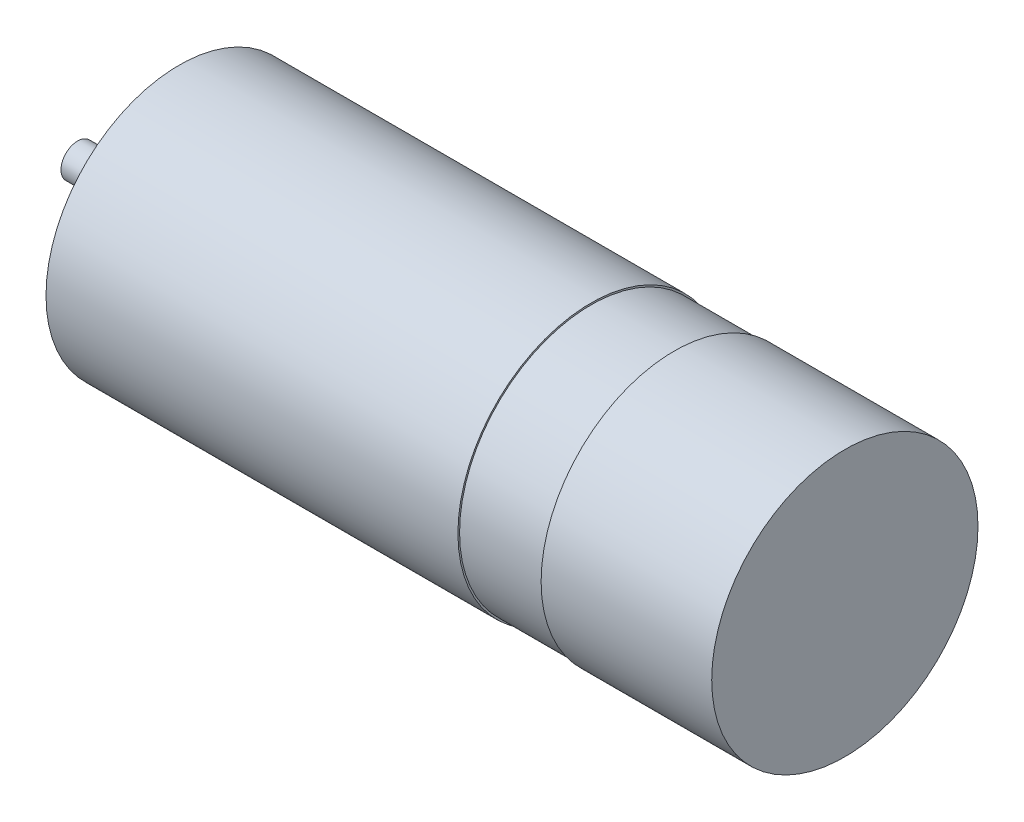
ISO-10303-21;
HEADER;
FILE_DESCRIPTION(('STEP AP214'),'2;1');
FILE_NAME('part.step','',(''),(''),'','','');
FILE_SCHEMA(('AUTOMOTIVE_DESIGN { 1 0 10303 214 1 1 1 1 }'));
ENDSEC;
DATA;
#1=APPLICATION_CONTEXT('core data for automotive mechanical design processes');
#2=APPLICATION_PROTOCOL_DEFINITION('international standard','automotive_design',2000,#1);
#3=PRODUCT_CONTEXT('',#1,'mechanical');
#4=PRODUCT('Part','Part','',(#3));
#5=PRODUCT_RELATED_PRODUCT_CATEGORY('part','',(#4));
#6=PRODUCT_DEFINITION_FORMATION('','',#4);
#7=PRODUCT_DEFINITION_CONTEXT('part definition',#1,'design');
#8=PRODUCT_DEFINITION('design','',#6,#7);
#9=PRODUCT_DEFINITION_SHAPE('','',#8);
#10=(LENGTH_UNIT() NAMED_UNIT(*) SI_UNIT(.MILLI.,.METRE.));
#11=(NAMED_UNIT(*) PLANE_ANGLE_UNIT() SI_UNIT($,.RADIAN.));
#12=(NAMED_UNIT(*) SI_UNIT($,.STERADIAN.) SOLID_ANGLE_UNIT());
#13=UNCERTAINTY_MEASURE_WITH_UNIT(LENGTH_MEASURE(1.E-05),#10,'distance_accuracy_value','');
#14=(GEOMETRIC_REPRESENTATION_CONTEXT(3) GLOBAL_UNCERTAINTY_ASSIGNED_CONTEXT((#13)) GLOBAL_UNIT_ASSIGNED_CONTEXT((#10,
#11,#12)) REPRESENTATION_CONTEXT('',''));
#15=CARTESIAN_POINT('',(0.,0.,0.));
#16=DIRECTION('',(0.,0.,1.));
#17=DIRECTION('',(1.,0.,0.));
#18=AXIS2_PLACEMENT_3D('',#15,#16,#17);
#19=CARTESIAN_POINT('',(0.,1.,0.));
#20=DIRECTION('',(1.,0.,0.));
#21=DIRECTION('',(0.,0.,-1.));
#22=AXIS2_PLACEMENT_3D('',#19,#20,#21);
#23=PLANE('',#22);
#24=CARTESIAN_POINT('',(0.,0.,0.));
#25=DIRECTION('',(-1.,0.,0.));
#26=DIRECTION('',(0.,0.,1.));
#27=AXIS2_PLACEMENT_3D('',#24,#25,#26);
#28=CIRCLE('',#27,1.);
#29=CARTESIAN_POINT('',(0.,0.,1.));
#30=VERTEX_POINT('',#29);
#31=EDGE_CURVE('E65',#30,#30,#28,.T.);
#32=ORIENTED_EDGE('',*,*,#31,.T.);
#33=EDGE_LOOP('',(#32));
#34=FACE_BOUND('',#33,.T.);
#35=ADVANCED_FACE('F31',(#34),#23,.F.);
#36=CARTESIAN_POINT('',(46.1,0.,0.));
#37=DIRECTION('',(-1.,0.,0.));
#38=DIRECTION('',(0.,0.,1.));
#39=AXIS2_PLACEMENT_3D('',#36,#37,#38);
#40=PLANE('',#39);
#41=CARTESIAN_POINT('',(46.1,0.,0.));
#42=DIRECTION('',(-1.,0.,0.));
#43=DIRECTION('',(0.,0.,1.));
#44=AXIS2_PLACEMENT_3D('',#41,#42,#43);
#45=CIRCLE('',#44,8.);
#46=CARTESIAN_POINT('',(46.1,0.,8.));
#47=VERTEX_POINT('',#46);
#48=EDGE_CURVE('E10',#47,#47,#45,.T.);
#49=ORIENTED_EDGE('',*,*,#48,.F.);
#50=EDGE_LOOP('',(#49));
#51=FACE_BOUND('',#50,.T.);
#52=ADVANCED_FACE('F119',(#51),#40,.F.);
#53=CARTESIAN_POINT('',(0.,0.,0.));
#54=DIRECTION('',(-1.,0.,0.));
#55=DIRECTION('',(0.,0.,1.));
#56=AXIS2_PLACEMENT_3D('',#53,#54,#55);
#57=CYLINDRICAL_SURFACE('',#56,8.);
#58=CARTESIAN_POINT('',(35.85,0.,0.));
#59=DIRECTION('',(-1.,0.,0.));
#60=DIRECTION('',(0.,0.,1.));
#61=AXIS2_PLACEMENT_3D('',#58,#59,#60);
#62=CIRCLE('',#61,8.);
#63=CARTESIAN_POINT('',(35.85,0.,8.));
#64=VERTEX_POINT('',#63);
#65=EDGE_CURVE('E37',#64,#64,#62,.T.);
#66=ORIENTED_EDGE('',*,*,#65,.F.);
#67=EDGE_LOOP('',(#66));
#68=FACE_BOUND('',#67,.T.);
#69=ORIENTED_EDGE('',*,*,#48,.T.);
#70=EDGE_LOOP('',(#69));
#71=FACE_BOUND('',#70,.T.);
#72=ADVANCED_FACE('F114',(#68,#71),#57,.T.);
#73=CARTESIAN_POINT('',(35.85,8.,0.));
#74=DIRECTION('',(1.,0.,0.));
#75=DIRECTION('',(0.,0.,-1.));
#76=AXIS2_PLACEMENT_3D('',#73,#74,#75);
#77=PLANE('',#76);
#78=CARTESIAN_POINT('',(35.85,0.,0.));
#79=DIRECTION('',(-1.,0.,0.));
#80=DIRECTION('',(0.,0.,1.));
#81=AXIS2_PLACEMENT_3D('',#78,#79,#80);
#82=CIRCLE('',#81,7.89999999999999);
#83=CARTESIAN_POINT('',(35.85,0.,7.89999999999999));
#84=VERTEX_POINT('',#83);
#85=EDGE_CURVE('E41',#84,#84,#82,.T.);
#86=ORIENTED_EDGE('',*,*,#85,.F.);
#87=EDGE_LOOP('',(#86));
#88=FACE_BOUND('',#87,.T.);
#89=ORIENTED_EDGE('',*,*,#65,.T.);
#90=EDGE_LOOP('',(#89));
#91=FACE_BOUND('',#90,.T.);
#92=ADVANCED_FACE('F109',(#88,#91),#77,.F.);
#93=CARTESIAN_POINT('',(0.,0.,0.));
#94=DIRECTION('',(-1.,0.,0.));
#95=DIRECTION('',(0.,0.,1.));
#96=AXIS2_PLACEMENT_3D('',#93,#94,#95);
#97=CYLINDRICAL_SURFACE('',#96,7.89999999999999);
#98=CARTESIAN_POINT('',(30.85,0.,0.));
#99=DIRECTION('',(-1.,0.,0.));
#100=DIRECTION('',(0.,0.,1.));
#101=AXIS2_PLACEMENT_3D('',#98,#99,#100);
#102=CIRCLE('',#101,7.9);
#103=CARTESIAN_POINT('',(30.85,0.,7.9));
#104=VERTEX_POINT('',#103);
#105=EDGE_CURVE('E45',#104,#104,#102,.T.);
#106=ORIENTED_EDGE('',*,*,#105,.F.);
#107=EDGE_LOOP('',(#106));
#108=FACE_BOUND('',#107,.T.);
#109=ORIENTED_EDGE('',*,*,#85,.T.);
#110=EDGE_LOOP('',(#109));
#111=FACE_BOUND('',#110,.T.);
#112=ADVANCED_FACE('F103',(#108,#111),#97,.T.);
#113=CARTESIAN_POINT('',(30.85,7.9,0.));
#114=DIRECTION('',(-1.,0.,0.));
#115=DIRECTION('',(0.,0.,1.));
#116=AXIS2_PLACEMENT_3D('',#113,#114,#115);
#117=PLANE('',#116);
#118=CARTESIAN_POINT('',(30.85,0.,0.));
#119=DIRECTION('',(-1.,0.,0.));
#120=DIRECTION('',(0.,0.,1.));
#121=AXIS2_PLACEMENT_3D('',#118,#119,#120);
#122=CIRCLE('',#121,8.);
#123=CARTESIAN_POINT('',(30.85,0.,8.));
#124=VERTEX_POINT('',#123);
#125=EDGE_CURVE('E50',#124,#124,#122,.T.);
#126=ORIENTED_EDGE('',*,*,#125,.F.);
#127=EDGE_LOOP('',(#126));
#128=FACE_BOUND('',#127,.T.);
#129=ORIENTED_EDGE('',*,*,#105,.T.);
#130=EDGE_LOOP('',(#129));
#131=FACE_BOUND('',#130,.T.);
#132=ADVANCED_FACE('F97',(#128,#131),#117,.F.);
#133=CARTESIAN_POINT('',(0.,0.,0.));
#134=DIRECTION('',(-1.,0.,0.));
#135=DIRECTION('',(0.,0.,1.));
#136=AXIS2_PLACEMENT_3D('',#133,#134,#135);
#137=CYLINDRICAL_SURFACE('',#136,8.);
#138=CARTESIAN_POINT('',(6.1,0.,0.));
#139=DIRECTION('',(-1.,0.,0.));
#140=DIRECTION('',(0.,0.,1.));
#141=AXIS2_PLACEMENT_3D('',#138,#139,#140);
#142=CIRCLE('',#141,8.);
#143=CARTESIAN_POINT('',(6.1,0.,8.));
#144=VERTEX_POINT('',#143);
#145=EDGE_CURVE('E53',#144,#144,#142,.T.);
#146=ORIENTED_EDGE('',*,*,#145,.F.);
#147=EDGE_LOOP('',(#146));
#148=FACE_BOUND('',#147,.T.);
#149=ORIENTED_EDGE('',*,*,#125,.T.);
#150=EDGE_LOOP('',(#149));
#151=FACE_BOUND('',#150,.T.);
#152=ADVANCED_FACE('F91',(#148,#151),#137,.T.);
#153=CARTESIAN_POINT('',(6.1,8.,0.));
#154=DIRECTION('',(1.,0.,0.));
#155=DIRECTION('',(0.,0.,-1.));
#156=AXIS2_PLACEMENT_3D('',#153,#154,#155);
#157=PLANE('',#156);
#158=CARTESIAN_POINT('',(6.1,0.,0.));
#159=DIRECTION('',(-1.,0.,0.));
#160=DIRECTION('',(0.,0.,1.));
#161=AXIS2_PLACEMENT_3D('',#158,#159,#160);
#162=CIRCLE('',#161,4.5);
#163=CARTESIAN_POINT('',(6.1,0.,4.5));
#164=VERTEX_POINT('',#163);
#165=EDGE_CURVE('E56',#164,#164,#162,.T.);
#166=ORIENTED_EDGE('',*,*,#165,.F.);
#167=EDGE_LOOP('',(#166));
#168=FACE_BOUND('',#167,.T.);
#169=ORIENTED_EDGE('',*,*,#145,.T.);
#170=EDGE_LOOP('',(#169));
#171=FACE_BOUND('',#170,.T.);
#172=ADVANCED_FACE('F85',(#168,#171),#157,.F.);
#173=CARTESIAN_POINT('',(0.,0.,0.));
#174=DIRECTION('',(-1.,0.,0.));
#175=DIRECTION('',(0.,0.,1.));
#176=AXIS2_PLACEMENT_3D('',#173,#174,#175);
#177=CYLINDRICAL_SURFACE('',#176,4.5);
#178=CARTESIAN_POINT('',(5.1,0.,0.));
#179=DIRECTION('',(-1.,0.,0.));
#180=DIRECTION('',(0.,0.,1.));
#181=AXIS2_PLACEMENT_3D('',#178,#179,#180);
#182=CIRCLE('',#181,4.5);
#183=CARTESIAN_POINT('',(5.1,0.,4.5));
#184=VERTEX_POINT('',#183);
#185=EDGE_CURVE('E59',#184,#184,#182,.T.);
#186=ORIENTED_EDGE('',*,*,#185,.F.);
#187=EDGE_LOOP('',(#186));
#188=FACE_BOUND('',#187,.T.);
#189=ORIENTED_EDGE('',*,*,#165,.T.);
#190=EDGE_LOOP('',(#189));
#191=FACE_BOUND('',#190,.T.);
#192=ADVANCED_FACE('F79',(#188,#191),#177,.T.);
#193=CARTESIAN_POINT('',(5.1,4.5,0.));
#194=DIRECTION('',(1.,0.,0.));
#195=DIRECTION('',(0.,0.,-1.));
#196=AXIS2_PLACEMENT_3D('',#193,#194,#195);
#197=PLANE('',#196);
#198=CARTESIAN_POINT('',(5.1,0.,0.));
#199=DIRECTION('',(-1.,0.,0.));
#200=DIRECTION('',(0.,0.,1.));
#201=AXIS2_PLACEMENT_3D('',#198,#199,#200);
#202=CIRCLE('',#201,1.);
#203=CARTESIAN_POINT('',(5.1,0.,1.));
#204=VERTEX_POINT('',#203);
#205=EDGE_CURVE('E62',#204,#204,#202,.T.);
#206=ORIENTED_EDGE('',*,*,#205,.F.);
#207=EDGE_LOOP('',(#206));
#208=FACE_BOUND('',#207,.T.);
#209=ORIENTED_EDGE('',*,*,#185,.T.);
#210=EDGE_LOOP('',(#209));
#211=FACE_BOUND('',#210,.T.);
#212=ADVANCED_FACE('F73',(#208,#211),#197,.F.);
#213=CARTESIAN_POINT('',(0.,0.,0.));
#214=DIRECTION('',(-1.,0.,0.));
#215=DIRECTION('',(0.,0.,1.));
#216=AXIS2_PLACEMENT_3D('',#213,#214,#215);
#217=CYLINDRICAL_SURFACE('',#216,1.);
#218=ORIENTED_EDGE('',*,*,#31,.F.);
#219=EDGE_LOOP('',(#218));
#220=FACE_BOUND('',#219,.T.);
#221=ORIENTED_EDGE('',*,*,#205,.T.);
#222=EDGE_LOOP('',(#221));
#223=FACE_BOUND('',#222,.T.);
#224=ADVANCED_FACE('F70',(#220,#223),#217,.T.);
#225=CLOSED_SHELL('',(#35,#52,#72,#92,#112,#132,#152,#172,#192,#212,#224));
#226=MANIFOLD_SOLID_BREP('B2',#225);
#227=ADVANCED_BREP_SHAPE_REPRESENTATION('',(#18,#226),#14);
#228=SHAPE_DEFINITION_REPRESENTATION(#9,#227);
ENDSEC;
END-ISO-10303-21;
